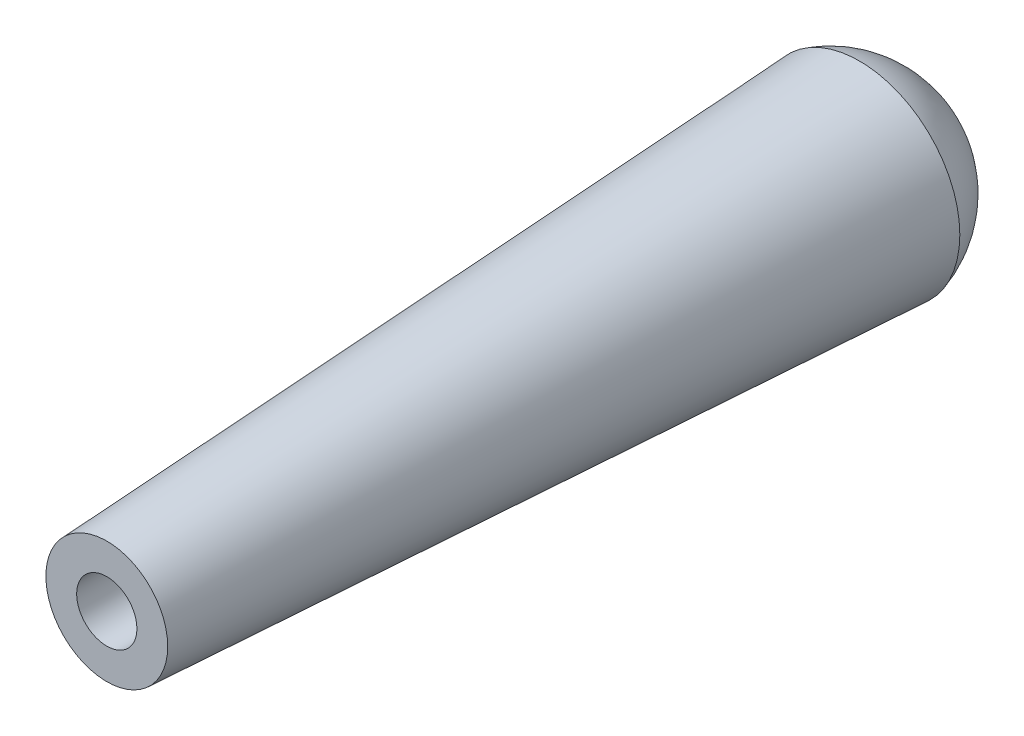
ISO-10303-21;
HEADER;
FILE_DESCRIPTION(('STEP AP214'),'2;1');
FILE_NAME('part.step','',(''),(''),'','','');
FILE_SCHEMA(('AUTOMOTIVE_DESIGN { 1 0 10303 214 1 1 1 1 }'));
ENDSEC;
DATA;
#1=APPLICATION_CONTEXT('core data for automotive mechanical design processes');
#2=APPLICATION_PROTOCOL_DEFINITION('international standard','automotive_design',2000,#1);
#3=PRODUCT_CONTEXT('',#1,'mechanical');
#4=PRODUCT('Part','Part','',(#3));
#5=PRODUCT_RELATED_PRODUCT_CATEGORY('part','',(#4));
#6=PRODUCT_DEFINITION_FORMATION('','',#4);
#7=PRODUCT_DEFINITION_CONTEXT('part definition',#1,'design');
#8=PRODUCT_DEFINITION('design','',#6,#7);
#9=PRODUCT_DEFINITION_SHAPE('','',#8);
#10=(LENGTH_UNIT() NAMED_UNIT(*) SI_UNIT(.MILLI.,.METRE.));
#11=(NAMED_UNIT(*) PLANE_ANGLE_UNIT() SI_UNIT($,.RADIAN.));
#12=(NAMED_UNIT(*) SI_UNIT($,.STERADIAN.) SOLID_ANGLE_UNIT());
#13=UNCERTAINTY_MEASURE_WITH_UNIT(LENGTH_MEASURE(1.E-05),#10,'distance_accuracy_value','');
#14=(GEOMETRIC_REPRESENTATION_CONTEXT(3) GLOBAL_UNCERTAINTY_ASSIGNED_CONTEXT((#13)) GLOBAL_UNIT_ASSIGNED_CONTEXT((#10,
#11,#12)) REPRESENTATION_CONTEXT('',''));
#15=CARTESIAN_POINT('',(0.,0.,0.));
#16=DIRECTION('',(0.,0.,1.));
#17=DIRECTION('',(1.,0.,0.));
#18=AXIS2_PLACEMENT_3D('',#15,#16,#17);
#19=CARTESIAN_POINT('',(0.,0.,0.));
#20=DIRECTION('',(0.,0.,-1.));
#21=DIRECTION('',(1.,0.,0.));
#22=AXIS2_PLACEMENT_3D('',#19,#20,#21);
#23=CONICAL_SURFACE('',#22,50.8,0.0523598775598299);
#24=CARTESIAN_POINT('',(0.,0.,381.));
#25=DIRECTION('',(0.,0.,1.));
#26=DIRECTION('',(1.,0.,0.));
#27=AXIS2_PLACEMENT_3D('',#24,#25,#26);
#28=CIRCLE('',#27,30.8326360931613);
#29=CARTESIAN_POINT('',(30.8326360931613,0.,381.));
#30=VERTEX_POINT('',#29);
#31=EDGE_CURVE('E10',#30,#30,#28,.T.);
#32=ORIENTED_EDGE('',*,*,#31,.F.);
#33=EDGE_LOOP('',(#32));
#34=FACE_BOUND('',#33,.T.);
#35=CARTESIAN_POINT('',(0.,0.,0.));
#36=DIRECTION('',(0.,0.,1.));
#37=DIRECTION('',(1.,0.,0.));
#38=AXIS2_PLACEMENT_3D('',#35,#36,#37);
#39=CIRCLE('',#38,50.8);
#40=CARTESIAN_POINT('',(50.8,0.,0.));
#41=VERTEX_POINT('',#40);
#42=EDGE_CURVE('E35',#41,#41,#39,.T.);
#43=ORIENTED_EDGE('',*,*,#42,.T.);
#44=EDGE_LOOP('',(#43));
#45=FACE_BOUND('',#44,.T.);
#46=ADVANCED_FACE('F31',(#34,#45),#23,.T.);
#47=CARTESIAN_POINT('',(0.,0.,381.));
#48=DIRECTION('',(0.,0.,1.));
#49=DIRECTION('',(1.,0.,0.));
#50=AXIS2_PLACEMENT_3D('',#47,#48,#49);
#51=PLANE('',#50);
#52=CARTESIAN_POINT('',(0.,0.,381.));
#53=DIRECTION('',(0.,0.,1.));
#54=DIRECTION('',(1.,0.,0.));
#55=AXIS2_PLACEMENT_3D('',#52,#53,#54);
#56=CIRCLE('',#55,15.24);
#57=CARTESIAN_POINT('',(15.24,0.,381.));
#58=VERTEX_POINT('',#57);
#59=EDGE_CURVE('E44',#58,#58,#56,.T.);
#60=ORIENTED_EDGE('',*,*,#59,.F.);
#61=EDGE_LOOP('',(#60));
#62=FACE_BOUND('',#61,.T.);
#63=ORIENTED_EDGE('',*,*,#31,.T.);
#64=EDGE_LOOP('',(#63));
#65=FACE_BOUND('',#64,.T.);
#66=ADVANCED_FACE('F58',(#62,#65),#51,.T.);
#67=CARTESIAN_POINT('',(0.,0.,14.8166666666667));
#68=DIRECTION('',(0.,0.,1.));
#69=DIRECTION('',(1.,0.,0.));
#70=AXIS2_PLACEMENT_3D('',#67,#68,#69);
#71=SPHERICAL_SURFACE('',#70,52.9166666666667);
#72=ORIENTED_EDGE('',*,*,#42,.F.);
#73=EDGE_LOOP('',(#72));
#74=FACE_BOUND('',#73,.T.);
#75=ADVANCED_FACE('F33',(#74),#71,.T.);
#76=CARTESIAN_POINT('',(0.,0.,127.));
#77=DIRECTION('',(0.,0.,1.));
#78=DIRECTION('',(1.,0.,0.));
#79=AXIS2_PLACEMENT_3D('',#76,#77,#78);
#80=CYLINDRICAL_SURFACE('',#79,15.24);
#81=CARTESIAN_POINT('',(0.,0.,127.));
#82=DIRECTION('',(0.,0.,1.));
#83=DIRECTION('',(1.,0.,0.));
#84=AXIS2_PLACEMENT_3D('',#81,#82,#83);
#85=CIRCLE('',#84,15.24);
#86=CARTESIAN_POINT('',(15.24,0.,127.));
#87=VERTEX_POINT('',#86);
#88=EDGE_CURVE('E42',#87,#87,#85,.T.);
#89=ORIENTED_EDGE('',*,*,#88,.F.);
#90=EDGE_LOOP('',(#89));
#91=FACE_BOUND('',#90,.T.);
#92=ORIENTED_EDGE('',*,*,#59,.T.);
#93=EDGE_LOOP('',(#92));
#94=FACE_BOUND('',#93,.T.);
#95=ADVANCED_FACE('F52',(#91,#94),#80,.F.);
#96=CARTESIAN_POINT('',(0.,0.,127.));
#97=DIRECTION('',(0.,0.,1.));
#98=DIRECTION('',(1.,0.,0.));
#99=AXIS2_PLACEMENT_3D('',#96,#97,#98);
#100=PLANE('',#99);
#101=ORIENTED_EDGE('',*,*,#88,.T.);
#102=EDGE_LOOP('',(#101));
#103=FACE_BOUND('',#102,.T.);
#104=ADVANCED_FACE('F50',(#103),#100,.T.);
#105=CLOSED_SHELL('',(#46,#66,#75,#95,#104));
#106=MANIFOLD_SOLID_BREP('B2',#105);
#107=ADVANCED_BREP_SHAPE_REPRESENTATION('',(#18,#106),#14);
#108=SHAPE_DEFINITION_REPRESENTATION(#9,#107);
ENDSEC;
END-ISO-10303-21;
